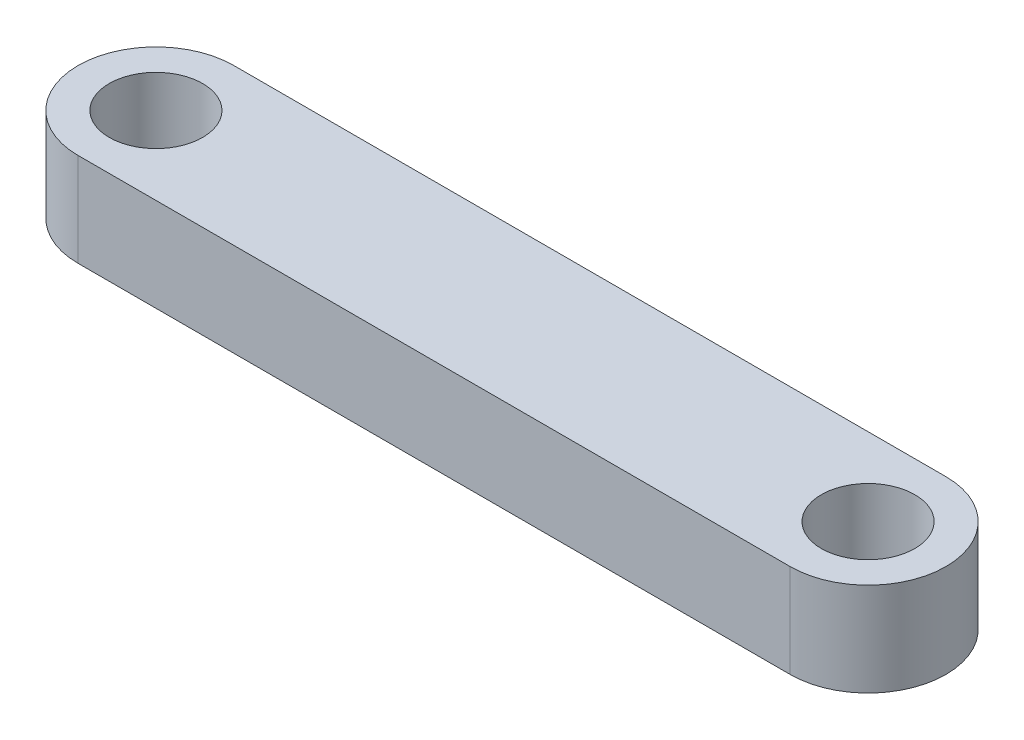
ISO-10303-21;
HEADER;
FILE_DESCRIPTION(('STEP AP214'),'2;1');
FILE_NAME('part.step','',(''),(''),'','','');
FILE_SCHEMA(('AUTOMOTIVE_DESIGN { 1 0 10303 214 1 1 1 1 }'));
ENDSEC;
DATA;
#1=APPLICATION_CONTEXT('core data for automotive mechanical design processes');
#2=APPLICATION_PROTOCOL_DEFINITION('international standard','automotive_design',2000,#1);
#3=PRODUCT_CONTEXT('',#1,'mechanical');
#4=PRODUCT('Part','Part','',(#3));
#5=PRODUCT_RELATED_PRODUCT_CATEGORY('part','',(#4));
#6=PRODUCT_DEFINITION_FORMATION('','',#4);
#7=PRODUCT_DEFINITION_CONTEXT('part definition',#1,'design');
#8=PRODUCT_DEFINITION('design','',#6,#7);
#9=PRODUCT_DEFINITION_SHAPE('','',#8);
#10=(LENGTH_UNIT() NAMED_UNIT(*) SI_UNIT(.MILLI.,.METRE.));
#11=(NAMED_UNIT(*) PLANE_ANGLE_UNIT() SI_UNIT($,.RADIAN.));
#12=(NAMED_UNIT(*) SI_UNIT($,.STERADIAN.) SOLID_ANGLE_UNIT());
#13=UNCERTAINTY_MEASURE_WITH_UNIT(LENGTH_MEASURE(1.E-05),#10,'distance_accuracy_value','');
#14=(GEOMETRIC_REPRESENTATION_CONTEXT(3) GLOBAL_UNCERTAINTY_ASSIGNED_CONTEXT((#13)) GLOBAL_UNIT_ASSIGNED_CONTEXT((#10,
#11,#12)) REPRESENTATION_CONTEXT('',''));
#15=CARTESIAN_POINT('',(0.,0.,0.));
#16=DIRECTION('',(0.,0.,1.));
#17=DIRECTION('',(1.,0.,0.));
#18=AXIS2_PLACEMENT_3D('',#15,#16,#17);
#19=CARTESIAN_POINT('',(11.43,1.5,0.));
#20=DIRECTION('',(0.,1.,0.));
#21=DIRECTION('',(0.,0.,1.));
#22=AXIS2_PLACEMENT_3D('',#19,#20,#21);
#23=PLANE('',#22);
#24=CARTESIAN_POINT('',(-11.43,1.5,0.));
#25=DIRECTION('',(0.,1.,0.));
#26=DIRECTION('',(0.,0.,1.));
#27=AXIS2_PLACEMENT_3D('',#24,#25,#26);
#28=CIRCLE('',#27,1.5);
#29=CARTESIAN_POINT('',(-11.43,1.5,1.5));
#30=VERTEX_POINT('',#29);
#31=EDGE_CURVE('E108',#30,#30,#28,.T.);
#32=ORIENTED_EDGE('',*,*,#31,.F.);
#33=EDGE_LOOP('',(#32));
#34=FACE_BOUND('',#33,.T.);
#35=CARTESIAN_POINT('',(11.43,1.5,0.));
#36=DIRECTION('',(0.,1.,0.));
#37=DIRECTION('',(0.,0.,1.));
#38=AXIS2_PLACEMENT_3D('',#35,#36,#37);
#39=CIRCLE('',#38,2.5);
#40=CARTESIAN_POINT('',(11.43,1.5,2.5));
#41=VERTEX_POINT('',#40);
#42=CARTESIAN_POINT('',(11.43,1.5,-2.5));
#43=VERTEX_POINT('',#42);
#44=EDGE_CURVE('E93',#41,#43,#39,.T.);
#45=ORIENTED_EDGE('',*,*,#44,.T.);
#46=DIRECTION('',(-1.,0.,0.));
#47=VECTOR('',#46,1.);
#48=CARTESIAN_POINT('',(-11.43,1.5,-2.5));
#49=LINE('',#48,#47);
#50=CARTESIAN_POINT('',(-11.43,1.5,-2.5));
#51=VERTEX_POINT('',#50);
#52=EDGE_CURVE('E88',#43,#51,#49,.T.);
#53=ORIENTED_EDGE('',*,*,#52,.T.);
#54=CARTESIAN_POINT('',(-11.43,1.5,0.));
#55=DIRECTION('',(0.,1.,0.));
#56=DIRECTION('',(0.,0.,1.));
#57=AXIS2_PLACEMENT_3D('',#54,#55,#56);
#58=CIRCLE('',#57,2.5);
#59=CARTESIAN_POINT('',(-11.43,1.5,2.5));
#60=VERTEX_POINT('',#59);
#61=EDGE_CURVE('E91',#51,#60,#58,.T.);
#62=ORIENTED_EDGE('',*,*,#61,.T.);
#63=DIRECTION('',(1.,0.,0.));
#64=VECTOR('',#63,1.);
#65=CARTESIAN_POINT('',(-11.43,1.5,2.5));
#66=LINE('',#65,#64);
#67=EDGE_CURVE('E58',#60,#41,#66,.T.);
#68=ORIENTED_EDGE('',*,*,#67,.T.);
#69=EDGE_LOOP('',(#45,#53,#62,#68));
#70=FACE_BOUND('',#69,.T.);
#71=CARTESIAN_POINT('',(11.43,1.5,0.));
#72=DIRECTION('',(0.,1.,0.));
#73=DIRECTION('',(0.,0.,1.));
#74=AXIS2_PLACEMENT_3D('',#71,#72,#73);
#75=CIRCLE('',#74,1.5);
#76=CARTESIAN_POINT('',(11.43,1.5,1.5));
#77=VERTEX_POINT('',#76);
#78=EDGE_CURVE('E123',#77,#77,#75,.T.);
#79=ORIENTED_EDGE('',*,*,#78,.F.);
#80=EDGE_LOOP('',(#79));
#81=FACE_BOUND('',#80,.T.);
#82=ADVANCED_FACE('F41',(#34,#70,#81),#23,.T.);
#83=CARTESIAN_POINT('',(11.43,-1.5,0.));
#84=DIRECTION('',(0.,1.,0.));
#85=DIRECTION('',(0.,0.,1.));
#86=AXIS2_PLACEMENT_3D('',#83,#84,#85);
#87=PLANE('',#86);
#88=CARTESIAN_POINT('',(11.43,-1.5,0.));
#89=DIRECTION('',(0.,1.,0.));
#90=DIRECTION('',(0.,0.,1.));
#91=AXIS2_PLACEMENT_3D('',#88,#89,#90);
#92=CIRCLE('',#91,2.5);
#93=CARTESIAN_POINT('',(11.43,-1.5,2.5));
#94=VERTEX_POINT('',#93);
#95=CARTESIAN_POINT('',(11.43,-1.5,-2.5));
#96=VERTEX_POINT('',#95);
#97=EDGE_CURVE('E105',#94,#96,#92,.T.);
#98=ORIENTED_EDGE('',*,*,#97,.F.);
#99=DIRECTION('',(1.,0.,0.));
#100=VECTOR('',#99,1.);
#101=CARTESIAN_POINT('',(-11.43,-1.5,2.5));
#102=LINE('',#101,#100);
#103=CARTESIAN_POINT('',(-11.43,-1.5,2.5));
#104=VERTEX_POINT('',#103);
#105=EDGE_CURVE('E81',#104,#94,#102,.T.);
#106=ORIENTED_EDGE('',*,*,#105,.F.);
#107=CARTESIAN_POINT('',(-11.43,-1.5,0.));
#108=DIRECTION('',(0.,1.,0.));
#109=DIRECTION('',(0.,0.,1.));
#110=AXIS2_PLACEMENT_3D('',#107,#108,#109);
#111=CIRCLE('',#110,2.5);
#112=CARTESIAN_POINT('',(-11.43,-1.5,-2.5));
#113=VERTEX_POINT('',#112);
#114=EDGE_CURVE('E75',#113,#104,#111,.T.);
#115=ORIENTED_EDGE('',*,*,#114,.F.);
#116=DIRECTION('',(-1.,0.,0.));
#117=VECTOR('',#116,1.);
#118=CARTESIAN_POINT('',(-11.43,-1.5,-2.5));
#119=LINE('',#118,#117);
#120=EDGE_CURVE('E97',#96,#113,#119,.T.);
#121=ORIENTED_EDGE('',*,*,#120,.F.);
#122=EDGE_LOOP('',(#98,#106,#115,#121));
#123=FACE_BOUND('',#122,.T.);
#124=CARTESIAN_POINT('',(-11.43,-1.5,0.));
#125=DIRECTION('',(0.,1.,0.));
#126=DIRECTION('',(0.,0.,1.));
#127=AXIS2_PLACEMENT_3D('',#124,#125,#126);
#128=CIRCLE('',#127,1.5);
#129=CARTESIAN_POINT('',(-11.43,-1.5,1.5));
#130=VERTEX_POINT('',#129);
#131=EDGE_CURVE('E120',#130,#130,#128,.T.);
#132=ORIENTED_EDGE('',*,*,#131,.T.);
#133=EDGE_LOOP('',(#132));
#134=FACE_BOUND('',#133,.T.);
#135=CARTESIAN_POINT('',(11.43,-1.5,0.));
#136=DIRECTION('',(0.,1.,0.));
#137=DIRECTION('',(0.,0.,1.));
#138=AXIS2_PLACEMENT_3D('',#135,#136,#137);
#139=CIRCLE('',#138,1.5);
#140=CARTESIAN_POINT('',(11.43,-1.5,1.5));
#141=VERTEX_POINT('',#140);
#142=EDGE_CURVE('E126',#141,#141,#139,.T.);
#143=ORIENTED_EDGE('',*,*,#142,.T.);
#144=EDGE_LOOP('',(#143));
#145=FACE_BOUND('',#144,.T.);
#146=ADVANCED_FACE('F116',(#123,#134,#145),#87,.F.);
#147=CARTESIAN_POINT('',(11.43,1.5,0.));
#148=DIRECTION('',(0.,-1.,0.));
#149=DIRECTION('',(0.,0.,-1.));
#150=AXIS2_PLACEMENT_3D('',#147,#148,#149);
#151=CYLINDRICAL_SURFACE('',#150,2.5);
#152=ORIENTED_EDGE('',*,*,#97,.T.);
#153=DIRECTION('',(0.,-1.,0.));
#154=VECTOR('',#153,1.);
#155=CARTESIAN_POINT('',(11.43,1.5,-2.5));
#156=LINE('',#155,#154);
#157=EDGE_CURVE('E11',#43,#96,#156,.T.);
#158=ORIENTED_EDGE('',*,*,#157,.F.);
#159=ORIENTED_EDGE('',*,*,#44,.F.);
#160=DIRECTION('',(0.,-1.,0.));
#161=VECTOR('',#160,1.);
#162=CARTESIAN_POINT('',(11.43,1.5,2.5));
#163=LINE('',#162,#161);
#164=EDGE_CURVE('E101',#41,#94,#163,.T.);
#165=ORIENTED_EDGE('',*,*,#164,.T.);
#166=EDGE_LOOP('',(#152,#158,#159,#165));
#167=FACE_BOUND('',#166,.T.);
#168=ADVANCED_FACE('F43',(#167),#151,.T.);
#169=CARTESIAN_POINT('',(-11.43,1.5,-2.5));
#170=DIRECTION('',(0.,0.,1.));
#171=DIRECTION('',(1.,0.,0.));
#172=AXIS2_PLACEMENT_3D('',#169,#170,#171);
#173=PLANE('',#172);
#174=ORIENTED_EDGE('',*,*,#120,.T.);
#175=DIRECTION('',(0.,-1.,0.));
#176=VECTOR('',#175,1.);
#177=CARTESIAN_POINT('',(-11.43,1.5,-2.5));
#178=LINE('',#177,#176);
#179=EDGE_CURVE('E50',#51,#113,#178,.T.);
#180=ORIENTED_EDGE('',*,*,#179,.F.);
#181=ORIENTED_EDGE('',*,*,#52,.F.);
#182=ORIENTED_EDGE('',*,*,#157,.T.);
#183=EDGE_LOOP('',(#174,#180,#181,#182));
#184=FACE_BOUND('',#183,.T.);
#185=ADVANCED_FACE('F96',(#184),#173,.F.);
#186=CARTESIAN_POINT('',(-11.43,1.5,0.));
#187=DIRECTION('',(0.,-1.,0.));
#188=DIRECTION('',(0.,0.,-1.));
#189=AXIS2_PLACEMENT_3D('',#186,#187,#188);
#190=CYLINDRICAL_SURFACE('',#189,2.5);
#191=ORIENTED_EDGE('',*,*,#114,.T.);
#192=DIRECTION('',(0.,-1.,0.));
#193=VECTOR('',#192,1.);
#194=CARTESIAN_POINT('',(-11.43,1.5,2.5));
#195=LINE('',#194,#193);
#196=EDGE_CURVE('E98',#60,#104,#195,.T.);
#197=ORIENTED_EDGE('',*,*,#196,.F.);
#198=ORIENTED_EDGE('',*,*,#61,.F.);
#199=ORIENTED_EDGE('',*,*,#179,.T.);
#200=EDGE_LOOP('',(#191,#197,#198,#199));
#201=FACE_BOUND('',#200,.T.);
#202=ADVANCED_FACE('F99',(#201),#190,.T.);
#203=CARTESIAN_POINT('',(-11.43,1.5,2.5));
#204=DIRECTION('',(0.,0.,-1.));
#205=DIRECTION('',(-1.,0.,0.));
#206=AXIS2_PLACEMENT_3D('',#203,#204,#205);
#207=PLANE('',#206);
#208=ORIENTED_EDGE('',*,*,#105,.T.);
#209=ORIENTED_EDGE('',*,*,#164,.F.);
#210=ORIENTED_EDGE('',*,*,#67,.F.);
#211=ORIENTED_EDGE('',*,*,#196,.T.);
#212=EDGE_LOOP('',(#208,#209,#210,#211));
#213=FACE_BOUND('',#212,.T.);
#214=ADVANCED_FACE('F113',(#213),#207,.F.);
#215=CARTESIAN_POINT('',(-11.43,1.5,0.));
#216=DIRECTION('',(0.,-1.,0.));
#217=DIRECTION('',(0.,0.,-1.));
#218=AXIS2_PLACEMENT_3D('',#215,#216,#217);
#219=CYLINDRICAL_SURFACE('',#218,1.5);
#220=ORIENTED_EDGE('',*,*,#31,.T.);
#221=EDGE_LOOP('',(#220));
#222=FACE_BOUND('',#221,.T.);
#223=ORIENTED_EDGE('',*,*,#131,.F.);
#224=EDGE_LOOP('',(#223));
#225=FACE_BOUND('',#224,.T.);
#226=ADVANCED_FACE('F143',(#222,#225),#219,.F.);
#227=CARTESIAN_POINT('',(11.43,1.5,0.));
#228=DIRECTION('',(0.,-1.,0.));
#229=DIRECTION('',(0.,0.,-1.));
#230=AXIS2_PLACEMENT_3D('',#227,#228,#229);
#231=CYLINDRICAL_SURFACE('',#230,1.5);
#232=ORIENTED_EDGE('',*,*,#78,.T.);
#233=EDGE_LOOP('',(#232));
#234=FACE_BOUND('',#233,.T.);
#235=ORIENTED_EDGE('',*,*,#142,.F.);
#236=EDGE_LOOP('',(#235));
#237=FACE_BOUND('',#236,.T.);
#238=ADVANCED_FACE('F132',(#234,#237),#231,.F.);
#239=CLOSED_SHELL('',(#82,#146,#168,#185,#202,#214,#226,#238));
#240=MANIFOLD_SOLID_BREP('B2',#239);
#241=ADVANCED_BREP_SHAPE_REPRESENTATION('',(#18,#240),#14);
#242=SHAPE_DEFINITION_REPRESENTATION(#9,#241);
ENDSEC;
END-ISO-10303-21;
